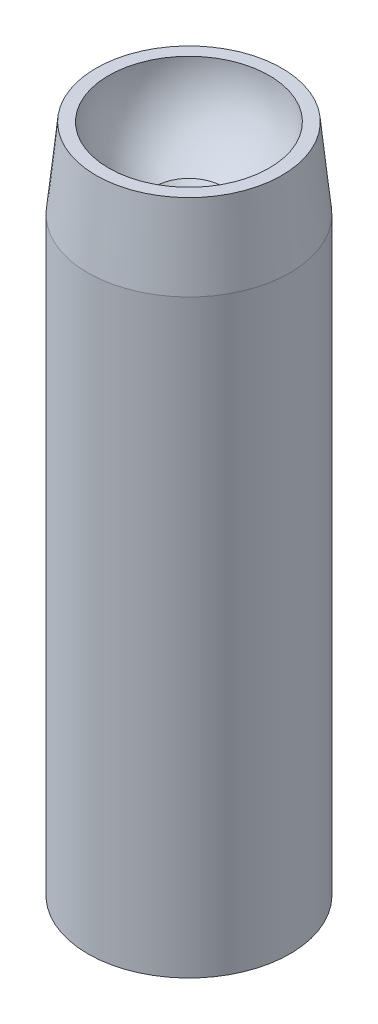
ISO-10303-21;
HEADER;
FILE_DESCRIPTION(('STEP AP214'),'2;1');
FILE_NAME('part.step','',(''),(''),'','','');
FILE_SCHEMA(('AUTOMOTIVE_DESIGN { 1 0 10303 214 1 1 1 1 }'));
ENDSEC;
DATA;
#1=APPLICATION_CONTEXT('core data for automotive mechanical design processes');
#2=APPLICATION_PROTOCOL_DEFINITION('international standard','automotive_design',2000,#1);
#3=PRODUCT_CONTEXT('',#1,'mechanical');
#4=PRODUCT('Part','Part','',(#3));
#5=PRODUCT_RELATED_PRODUCT_CATEGORY('part','',(#4));
#6=PRODUCT_DEFINITION_FORMATION('','',#4);
#7=PRODUCT_DEFINITION_CONTEXT('part definition',#1,'design');
#8=PRODUCT_DEFINITION('design','',#6,#7);
#9=PRODUCT_DEFINITION_SHAPE('','',#8);
#10=(LENGTH_UNIT() NAMED_UNIT(*) SI_UNIT(.MILLI.,.METRE.));
#11=(NAMED_UNIT(*) PLANE_ANGLE_UNIT() SI_UNIT($,.RADIAN.));
#12=(NAMED_UNIT(*) SI_UNIT($,.STERADIAN.) SOLID_ANGLE_UNIT());
#13=UNCERTAINTY_MEASURE_WITH_UNIT(LENGTH_MEASURE(1.E-05),#10,'distance_accuracy_value','');
#14=(GEOMETRIC_REPRESENTATION_CONTEXT(3) GLOBAL_UNCERTAINTY_ASSIGNED_CONTEXT((#13)) GLOBAL_UNIT_ASSIGNED_CONTEXT((#10,
#11,#12)) REPRESENTATION_CONTEXT('',''));
#15=CARTESIAN_POINT('',(0.,0.,0.));
#16=DIRECTION('',(0.,0.,1.));
#17=DIRECTION('',(1.,0.,0.));
#18=AXIS2_PLACEMENT_3D('',#15,#16,#17);
#19=CARTESIAN_POINT('',(0.,0.,0.));
#20=DIRECTION('',(0.,1.,0.));
#21=DIRECTION('',(0.,0.,1.));
#22=AXIS2_PLACEMENT_3D('',#19,#20,#21);
#23=PLANE('',#22);
#24=CARTESIAN_POINT('',(0.,0.,0.));
#25=DIRECTION('',(0.,1.,0.));
#26=DIRECTION('',(0.,0.,1.));
#27=AXIS2_PLACEMENT_3D('',#24,#25,#26);
#28=CIRCLE('',#27,6.);
#29=CARTESIAN_POINT('',(0.,0.,6.));
#30=VERTEX_POINT('',#29);
#31=EDGE_CURVE('E10',#30,#30,#28,.T.);
#32=ORIENTED_EDGE('',*,*,#31,.F.);
#33=EDGE_LOOP('',(#32));
#34=FACE_BOUND('',#33,.T.);
#35=CARTESIAN_POINT('',(0.,0.,0.));
#36=DIRECTION('',(0.,1.,0.));
#37=DIRECTION('',(0.,0.,1.));
#38=AXIS2_PLACEMENT_3D('',#35,#36,#37);
#39=CIRCLE('',#38,5.2);
#40=CARTESIAN_POINT('',(0.,0.,5.2));
#41=VERTEX_POINT('',#40);
#42=EDGE_CURVE('E39',#41,#41,#39,.T.);
#43=ORIENTED_EDGE('',*,*,#42,.T.);
#44=EDGE_LOOP('',(#43));
#45=FACE_BOUND('',#44,.T.);
#46=ADVANCED_FACE('F32',(#34,#45),#23,.F.);
#47=CARTESIAN_POINT('',(0.,25.,0.));
#48=DIRECTION('',(0.,-1.,0.));
#49=DIRECTION('',(0.,0.,-1.));
#50=AXIS2_PLACEMENT_3D('',#47,#48,#49);
#51=CYLINDRICAL_SURFACE('',#50,6.);
#52=ORIENTED_EDGE('',*,*,#31,.T.);
#53=EDGE_LOOP('',(#52));
#54=FACE_BOUND('',#53,.T.);
#55=CARTESIAN_POINT('',(0.,35.,0.));
#56=DIRECTION('',(0.,1.,0.));
#57=DIRECTION('',(0.,0.,1.));
#58=AXIS2_PLACEMENT_3D('',#55,#56,#57);
#59=CIRCLE('',#58,6.);
#60=CARTESIAN_POINT('',(0.,35.,6.));
#61=VERTEX_POINT('',#60);
#62=EDGE_CURVE('E47',#61,#61,#59,.T.);
#63=ORIENTED_EDGE('',*,*,#62,.F.);
#64=EDGE_LOOP('',(#63));
#65=FACE_BOUND('',#64,.T.);
#66=ADVANCED_FACE('F34',(#54,#65),#51,.T.);
#67=CARTESIAN_POINT('',(0.,25.,0.));
#68=DIRECTION('',(0.,-1.,0.));
#69=DIRECTION('',(0.,0.,-1.));
#70=AXIS2_PLACEMENT_3D('',#67,#68,#69);
#71=CYLINDRICAL_SURFACE('',#70,5.2);
#72=CARTESIAN_POINT('',(0.,25.,0.));
#73=DIRECTION('',(0.,1.,0.));
#74=DIRECTION('',(0.,0.,1.));
#75=AXIS2_PLACEMENT_3D('',#72,#73,#74);
#76=CIRCLE('',#75,5.2);
#77=CARTESIAN_POINT('',(0.,25.,5.2));
#78=VERTEX_POINT('',#77);
#79=EDGE_CURVE('E43',#78,#78,#76,.T.);
#80=ORIENTED_EDGE('',*,*,#79,.T.);
#81=EDGE_LOOP('',(#80));
#82=FACE_BOUND('',#81,.T.);
#83=ORIENTED_EDGE('',*,*,#42,.F.);
#84=EDGE_LOOP('',(#83));
#85=FACE_BOUND('',#84,.T.);
#86=ADVANCED_FACE('F95',(#82,#85),#71,.F.);
#87=CARTESIAN_POINT('',(0.,25.,0.));
#88=DIRECTION('',(0.,1.,0.));
#89=DIRECTION('',(0.,0.,1.));
#90=AXIS2_PLACEMENT_3D('',#87,#88,#89);
#91=PLANE('',#90);
#92=ORIENTED_EDGE('',*,*,#79,.F.);
#93=EDGE_LOOP('',(#92));
#94=FACE_BOUND('',#93,.T.);
#95=CARTESIAN_POINT('',(0.,25.,0.));
#96=DIRECTION('',(0.,1.,0.));
#97=DIRECTION('',(0.,0.,1.));
#98=AXIS2_PLACEMENT_3D('',#95,#96,#97);
#99=CIRCLE('',#98,5.);
#100=CARTESIAN_POINT('',(0.,25.,5.));
#101=VERTEX_POINT('',#100);
#102=EDGE_CURVE('E52',#101,#101,#99,.T.);
#103=ORIENTED_EDGE('',*,*,#102,.T.);
#104=EDGE_LOOP('',(#103));
#105=FACE_BOUND('',#104,.T.);
#106=ADVANCED_FACE('F87',(#94,#105),#91,.F.);
#107=CARTESIAN_POINT('',(0.,35.,0.));
#108=DIRECTION('',(0.,-1.,0.));
#109=DIRECTION('',(0.,0.,-1.));
#110=AXIS2_PLACEMENT_3D('',#107,#108,#109);
#111=CYLINDRICAL_SURFACE('',#110,5.);
#112=CARTESIAN_POINT('',(0.,35.,0.));
#113=DIRECTION('',(0.,-1.,0.));
#114=DIRECTION('',(0.,0.,-1.));
#115=AXIS2_PLACEMENT_3D('',#112,#113,#114);
#116=CIRCLE('',#115,5.);
#117=CARTESIAN_POINT('',(0.,35.,-5.));
#118=VERTEX_POINT('',#117);
#119=EDGE_CURVE('E55',#118,#118,#116,.T.);
#120=ORIENTED_EDGE('',*,*,#119,.F.);
#121=EDGE_LOOP('',(#120));
#122=FACE_BOUND('',#121,.T.);
#123=ORIENTED_EDGE('',*,*,#102,.F.);
#124=EDGE_LOOP('',(#123));
#125=FACE_BOUND('',#124,.T.);
#126=ADVANCED_FACE('F77',(#122,#125),#111,.F.);
#127=CARTESIAN_POINT('',(0.,39.7625,0.));
#128=DIRECTION('',(0.,-1.,0.));
#129=DIRECTION('',(0.,0.,-1.));
#130=AXIS2_PLACEMENT_3D('',#127,#128,#129);
#131=CONICAL_SURFACE('',#130,5.5125,0.102006917910113);
#132=ORIENTED_EDGE('',*,*,#62,.T.);
#133=EDGE_LOOP('',(#132));
#134=FACE_BOUND('',#133,.T.);
#135=CARTESIAN_POINT('',(0.,39.7625,0.));
#136=DIRECTION('',(0.,1.,0.));
#137=DIRECTION('',(0.,0.,1.));
#138=AXIS2_PLACEMENT_3D('',#135,#136,#137);
#139=CIRCLE('',#138,5.5125);
#140=CARTESIAN_POINT('',(0.,39.7625,5.5125));
#141=VERTEX_POINT('',#140);
#142=EDGE_CURVE('E67',#141,#141,#139,.T.);
#143=ORIENTED_EDGE('',*,*,#142,.F.);
#144=EDGE_LOOP('',(#143));
#145=FACE_BOUND('',#144,.T.);
#146=ADVANCED_FACE('F74',(#134,#145),#131,.T.);
#147=CARTESIAN_POINT('',(0.,35.,1.55969923765667));
#148=DIRECTION('',(0.,-1.,0.));
#149=DIRECTION('',(0.,0.,-1.));
#150=AXIS2_PLACEMENT_3D('',#147,#148,#149);
#151=PLANE('',#150);
#152=ORIENTED_EDGE('',*,*,#119,.T.);
#153=EDGE_LOOP('',(#152));
#154=FACE_BOUND('',#153,.T.);
#155=CARTESIAN_POINT('',(0.,35.,0.));
#156=DIRECTION('',(0.,1.,0.));
#157=DIRECTION('',(0.,0.,1.));
#158=AXIS2_PLACEMENT_3D('',#155,#156,#157);
#159=CIRCLE('',#158,1.55969923765668);
#160=CARTESIAN_POINT('',(0.,35.,1.55969923765667));
#161=VERTEX_POINT('',#160);
#162=EDGE_CURVE('E58',#161,#161,#159,.T.);
#163=ORIENTED_EDGE('',*,*,#162,.T.);
#164=EDGE_LOOP('',(#163));
#165=FACE_BOUND('',#164,.T.);
#166=ADVANCED_FACE('F76',(#154,#165),#151,.T.);
#167=CARTESIAN_POINT('',(0.,35.,0.));
#168=DIRECTION('',(0.,1.,0.));
#169=DIRECTION('',(0.,0.,1.));
#170=AXIS2_PLACEMENT_3D('',#167,#168,#169);
#171=CONICAL_SURFACE('',#170,1.55969923765668,0.785398163397456);
#172=CARTESIAN_POINT('',(0.,35.4403007623433,0.));
#173=DIRECTION('',(0.,1.,0.));
#174=DIRECTION('',(0.,0.,1.));
#175=AXIS2_PLACEMENT_3D('',#172,#173,#174);
#176=CIRCLE('',#175,2.);
#177=CARTESIAN_POINT('',(0.,35.4403007623433,2.));
#178=VERTEX_POINT('',#177);
#179=EDGE_CURVE('E61',#178,#178,#176,.T.);
#180=ORIENTED_EDGE('',*,*,#179,.T.);
#181=EDGE_LOOP('',(#180));
#182=FACE_BOUND('',#181,.T.);
#183=ORIENTED_EDGE('',*,*,#162,.F.);
#184=EDGE_LOOP('',(#183));
#185=FACE_BOUND('',#184,.T.);
#186=ADVANCED_FACE('F84',(#182,#185),#171,.F.);
#187=CARTESIAN_POINT('',(0.,39.7625,0.));
#188=DIRECTION('',(0.,1.,0.));
#189=DIRECTION('',(0.,0.,1.));
#190=AXIS2_PLACEMENT_3D('',#187,#188,#189);
#191=SPHERICAL_SURFACE('',#190,4.7625);
#192=CARTESIAN_POINT('',(0.,39.7625,0.));
#193=DIRECTION('',(0.,1.,0.));
#194=DIRECTION('',(0.,0.,1.));
#195=AXIS2_PLACEMENT_3D('',#192,#193,#194);
#196=CIRCLE('',#195,4.7625);
#197=CARTESIAN_POINT('',(0.,39.7625,4.7625));
#198=VERTEX_POINT('',#197);
#199=EDGE_CURVE('E64',#198,#198,#196,.T.);
#200=ORIENTED_EDGE('',*,*,#199,.T.);
#201=EDGE_LOOP('',(#200));
#202=FACE_BOUND('',#201,.T.);
#203=ORIENTED_EDGE('',*,*,#179,.F.);
#204=EDGE_LOOP('',(#203));
#205=FACE_BOUND('',#204,.T.);
#206=ADVANCED_FACE('F136',(#202,#205),#191,.F.);
#207=CARTESIAN_POINT('',(0.,39.7625,4.7625));
#208=DIRECTION('',(0.,1.,0.));
#209=DIRECTION('',(0.,0.,1.));
#210=AXIS2_PLACEMENT_3D('',#207,#208,#209);
#211=PLANE('',#210);
#212=ORIENTED_EDGE('',*,*,#142,.T.);
#213=EDGE_LOOP('',(#212));
#214=FACE_BOUND('',#213,.T.);
#215=ORIENTED_EDGE('',*,*,#199,.F.);
#216=EDGE_LOOP('',(#215));
#217=FACE_BOUND('',#216,.T.);
#218=ADVANCED_FACE('F71',(#214,#217),#211,.T.);
#219=CLOSED_SHELL('',(#46,#66,#86,#106,#126,#146,#166,#186,#206,#218));
#220=MANIFOLD_SOLID_BREP('B2',#219);
#221=ADVANCED_BREP_SHAPE_REPRESENTATION('',(#18,#220),#14);
#222=SHAPE_DEFINITION_REPRESENTATION(#9,#221);
ENDSEC;
END-ISO-10303-21;
